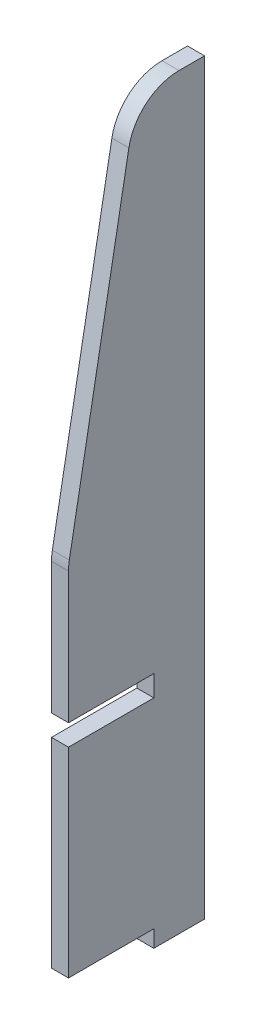
ISO-10303-21;
HEADER;
FILE_DESCRIPTION(('STEP AP214'),'2;1');
FILE_NAME('part.step','',(''),(''),'','','');
FILE_SCHEMA(('AUTOMOTIVE_DESIGN { 1 0 10303 214 1 1 1 1 }'));
ENDSEC;
DATA;
#1=APPLICATION_CONTEXT('core data for automotive mechanical design processes');
#2=APPLICATION_PROTOCOL_DEFINITION('international standard','automotive_design',2000,#1);
#3=PRODUCT_CONTEXT('',#1,'mechanical');
#4=PRODUCT('Part','Part','',(#3));
#5=PRODUCT_RELATED_PRODUCT_CATEGORY('part','',(#4));
#6=PRODUCT_DEFINITION_FORMATION('','',#4);
#7=PRODUCT_DEFINITION_CONTEXT('part definition',#1,'design');
#8=PRODUCT_DEFINITION('design','',#6,#7);
#9=PRODUCT_DEFINITION_SHAPE('','',#8);
#10=(LENGTH_UNIT() NAMED_UNIT(*) SI_UNIT(.MILLI.,.METRE.));
#11=(NAMED_UNIT(*) PLANE_ANGLE_UNIT() SI_UNIT($,.RADIAN.));
#12=(NAMED_UNIT(*) SI_UNIT($,.STERADIAN.) SOLID_ANGLE_UNIT());
#13=UNCERTAINTY_MEASURE_WITH_UNIT(LENGTH_MEASURE(1.E-05),#10,'distance_accuracy_value','');
#14=(GEOMETRIC_REPRESENTATION_CONTEXT(3) GLOBAL_UNCERTAINTY_ASSIGNED_CONTEXT((#13)) GLOBAL_UNIT_ASSIGNED_CONTEXT((#10,
#11,#12)) REPRESENTATION_CONTEXT('',''));
#15=CARTESIAN_POINT('',(0.,0.,0.));
#16=DIRECTION('',(0.,0.,1.));
#17=DIRECTION('',(1.,0.,0.));
#18=AXIS2_PLACEMENT_3D('',#15,#16,#17);
#19=CARTESIAN_POINT('',(135.,-58.8,-55.2));
#20=DIRECTION('',(0.,1.,0.));
#21=DIRECTION('',(0.,0.,1.));
#22=AXIS2_PLACEMENT_3D('',#19,#20,#21);
#23=PLANE('',#22);
#24=DIRECTION('',(0.,0.,-1.));
#25=VECTOR('',#24,1.);
#26=CARTESIAN_POINT('',(125.,-58.8,-55.2));
#27=LINE('',#26,#25);
#28=CARTESIAN_POINT('',(125.,-58.8,-5.));
#29=VERTEX_POINT('',#28);
#30=CARTESIAN_POINT('',(125.,-58.8,-55.2));
#31=VERTEX_POINT('',#30);
#32=EDGE_CURVE('E156',#29,#31,#27,.T.);
#33=ORIENTED_EDGE('',*,*,#32,.T.);
#34=DIRECTION('',(-1.,0.,0.));
#35=VECTOR('',#34,1.);
#36=CARTESIAN_POINT('',(135.,-58.8,-55.2));
#37=LINE('',#36,#35);
#38=CARTESIAN_POINT('',(135.,-58.8,-55.2));
#39=VERTEX_POINT('',#38);
#40=EDGE_CURVE('E137',#39,#31,#37,.T.);
#41=ORIENTED_EDGE('',*,*,#40,.F.);
#42=DIRECTION('',(0.,0.,-1.));
#43=VECTOR('',#42,1.);
#44=CARTESIAN_POINT('',(135.,-58.8,-55.2));
#45=LINE('',#44,#43);
#46=CARTESIAN_POINT('',(135.,-58.8,-5.));
#47=VERTEX_POINT('',#46);
#48=EDGE_CURVE('E144',#47,#39,#45,.T.);
#49=ORIENTED_EDGE('',*,*,#48,.F.);
#50=DIRECTION('',(-1.,0.,0.));
#51=VECTOR('',#50,1.);
#52=CARTESIAN_POINT('',(135.,-58.8,-5.));
#53=LINE('',#52,#51);
#54=EDGE_CURVE('E212',#47,#29,#53,.T.);
#55=ORIENTED_EDGE('',*,*,#54,.T.);
#56=EDGE_LOOP('',(#33,#41,#49,#55));
#57=FACE_BOUND('',#56,.T.);
#58=ADVANCED_FACE('F36',(#57),#23,.F.);
#59=CARTESIAN_POINT('',(135.,-58.8,-55.2));
#60=DIRECTION('',(0.,0.,-1.));
#61=DIRECTION('',(-1.,0.,0.));
#62=AXIS2_PLACEMENT_3D('',#59,#60,#61);
#63=PLANE('',#62);
#64=DIRECTION('',(0.,-1.,0.));
#65=VECTOR('',#64,1.);
#66=CARTESIAN_POINT('',(125.,-58.8,-55.2));
#67=LINE('',#66,#65);
#68=CARTESIAN_POINT('',(125.,-68.8,-55.2));
#69=VERTEX_POINT('',#68);
#70=EDGE_CURVE('E238',#31,#69,#67,.T.);
#71=ORIENTED_EDGE('',*,*,#70,.T.);
#72=DIRECTION('',(-1.,0.,0.));
#73=VECTOR('',#72,1.);
#74=CARTESIAN_POINT('',(135.,-68.8,-55.2));
#75=LINE('',#74,#73);
#76=CARTESIAN_POINT('',(135.,-68.8,-55.2));
#77=VERTEX_POINT('',#76);
#78=EDGE_CURVE('E140',#77,#69,#75,.T.);
#79=ORIENTED_EDGE('',*,*,#78,.F.);
#80=DIRECTION('',(0.,-1.,0.));
#81=VECTOR('',#80,1.);
#82=CARTESIAN_POINT('',(135.,-58.8,-55.2));
#83=LINE('',#82,#81);
#84=EDGE_CURVE('E133',#39,#77,#83,.T.);
#85=ORIENTED_EDGE('',*,*,#84,.F.);
#86=ORIENTED_EDGE('',*,*,#40,.T.);
#87=EDGE_LOOP('',(#71,#79,#85,#86));
#88=FACE_BOUND('',#87,.T.);
#89=ADVANCED_FACE('F135',(#88),#63,.F.);
#90=CARTESIAN_POINT('',(135.,-68.8,-55.2));
#91=DIRECTION('',(0.,1.,0.));
#92=DIRECTION('',(0.,0.,1.));
#93=AXIS2_PLACEMENT_3D('',#90,#91,#92);
#94=PLANE('',#93);
#95=DIRECTION('',(0.,0.,-1.));
#96=VECTOR('',#95,1.);
#97=CARTESIAN_POINT('',(125.,-68.8,-55.2));
#98=LINE('',#97,#96);
#99=CARTESIAN_POINT('',(125.,-68.8,-85.));
#100=VERTEX_POINT('',#99);
#101=EDGE_CURVE('E237',#69,#100,#98,.T.);
#102=ORIENTED_EDGE('',*,*,#101,.T.);
#103=DIRECTION('',(-1.,0.,0.));
#104=VECTOR('',#103,1.);
#105=CARTESIAN_POINT('',(135.,-68.8,-85.));
#106=LINE('',#105,#104);
#107=CARTESIAN_POINT('',(135.,-68.8,-85.));
#108=VERTEX_POINT('',#107);
#109=EDGE_CURVE('E162',#108,#100,#106,.T.);
#110=ORIENTED_EDGE('',*,*,#109,.F.);
#111=DIRECTION('',(0.,0.,-1.));
#112=VECTOR('',#111,1.);
#113=CARTESIAN_POINT('',(135.,-68.8,-55.2));
#114=LINE('',#113,#112);
#115=EDGE_CURVE('E143',#77,#108,#114,.T.);
#116=ORIENTED_EDGE('',*,*,#115,.F.);
#117=ORIENTED_EDGE('',*,*,#78,.T.);
#118=EDGE_LOOP('',(#102,#110,#116,#117));
#119=FACE_BOUND('',#118,.T.);
#120=ADVANCED_FACE('F235',(#119),#94,.F.);
#121=CARTESIAN_POINT('',(135.,371.,-85.));
#122=DIRECTION('',(0.,0.,1.));
#123=DIRECTION('',(1.,0.,0.));
#124=AXIS2_PLACEMENT_3D('',#121,#122,#123);
#125=PLANE('',#124);
#126=DIRECTION('',(0.,1.,0.));
#127=VECTOR('',#126,1.);
#128=CARTESIAN_POINT('',(125.,371.,-85.));
#129=LINE('',#128,#127);
#130=CARTESIAN_POINT('',(125.,371.,-85.));
#131=VERTEX_POINT('',#130);
#132=EDGE_CURVE('E202',#100,#131,#129,.T.);
#133=ORIENTED_EDGE('',*,*,#132,.T.);
#134=DIRECTION('',(-1.,0.,0.));
#135=VECTOR('',#134,1.);
#136=CARTESIAN_POINT('',(135.,371.,-85.));
#137=LINE('',#136,#135);
#138=CARTESIAN_POINT('',(135.,371.,-85.));
#139=VERTEX_POINT('',#138);
#140=EDGE_CURVE('E224',#139,#131,#137,.T.);
#141=ORIENTED_EDGE('',*,*,#140,.F.);
#142=DIRECTION('',(0.,1.,0.));
#143=VECTOR('',#142,1.);
#144=CARTESIAN_POINT('',(135.,-68.8,-85.));
#145=LINE('',#144,#143);
#146=EDGE_CURVE('E232',#108,#139,#145,.T.);
#147=ORIENTED_EDGE('',*,*,#146,.F.);
#148=ORIENTED_EDGE('',*,*,#109,.T.);
#149=EDGE_LOOP('',(#133,#141,#147,#148));
#150=FACE_BOUND('',#149,.T.);
#151=ADVANCED_FACE('F230',(#150),#125,.F.);
#152=CARTESIAN_POINT('',(135.,371.,-45.));
#153=DIRECTION('',(0.,-1.,0.));
#154=DIRECTION('',(0.,0.,-1.));
#155=AXIS2_PLACEMENT_3D('',#152,#153,#154);
#156=PLANE('',#155);
#157=DIRECTION('',(0.,0.,1.));
#158=VECTOR('',#157,1.);
#159=CARTESIAN_POINT('',(125.,371.,-45.));
#160=LINE('',#159,#158);
#161=CARTESIAN_POINT('',(125.,371.,-70.0332156459481));
#162=VERTEX_POINT('',#161);
#163=EDGE_CURVE('E198',#131,#162,#160,.T.);
#164=ORIENTED_EDGE('',*,*,#163,.T.);
#165=DIRECTION('',(-1.,0.,0.));
#166=VECTOR('',#165,1.);
#167=CARTESIAN_POINT('',(135.,371.,-70.0332156459481));
#168=LINE('',#167,#166);
#169=CARTESIAN_POINT('',(135.,371.,-70.0332156459481));
#170=VERTEX_POINT('',#169);
#171=EDGE_CURVE('E11',#162,#170,#168,.F.);
#172=ORIENTED_EDGE('',*,*,#171,.T.);
#173=DIRECTION('',(0.,0.,1.));
#174=VECTOR('',#173,1.);
#175=CARTESIAN_POINT('',(135.,371.,-45.));
#176=LINE('',#175,#174);
#177=EDGE_CURVE('E250',#139,#170,#176,.T.);
#178=ORIENTED_EDGE('',*,*,#177,.F.);
#179=ORIENTED_EDGE('',*,*,#140,.T.);
#180=EDGE_LOOP('',(#164,#172,#178,#179));
#181=FACE_BOUND('',#180,.T.);
#182=ADVANCED_FACE('F255',(#181),#156,.F.);
#183=CARTESIAN_POINT('',(135.,151.2,-5.));
#184=DIRECTION('',(0.,-0.179042993740706,-0.98384125060518));
#185=DIRECTION('',(0.,0.98384125060518,-0.179042993740706));
#186=AXIS2_PLACEMENT_3D('',#183,#184,#185);
#187=PLANE('',#186);
#188=DIRECTION('',(0.,-0.98384125060518,0.179042993740706));
#189=VECTOR('',#188,1.);
#190=CARTESIAN_POINT('',(125.,151.2,-5.));
#191=LINE('',#190,#189);
#192=CARTESIAN_POINT('',(125.,346.371289812221,-40.5179781277927));
#193=VERTEX_POINT('',#192);
#194=CARTESIAN_POINT('',(125.,153.863769837736,-5.48476248184458));
#195=VERTEX_POINT('',#194);
#196=EDGE_CURVE('E193',#193,#195,#191,.T.);
#197=ORIENTED_EDGE('',*,*,#196,.T.);
#198=DIRECTION('',(-1.,0.,0.));
#199=VECTOR('',#198,1.);
#200=CARTESIAN_POINT('',(135.,153.863769837736,-5.48476248184458));
#201=LINE('',#200,#199);
#202=CARTESIAN_POINT('',(135.,153.863769837736,-5.48476248184458));
#203=VERTEX_POINT('',#202);
#204=EDGE_CURVE('E57',#195,#203,#201,.F.);
#205=ORIENTED_EDGE('',*,*,#204,.T.);
#206=DIRECTION('',(0.,-0.98384125060518,0.179042993740706));
#207=VECTOR('',#206,1.);
#208=CARTESIAN_POINT('',(135.,151.2,-5.));
#209=LINE('',#208,#207);
#210=CARTESIAN_POINT('',(135.,346.371289812221,-40.5179781277927));
#211=VERTEX_POINT('',#210);
#212=EDGE_CURVE('E178',#211,#203,#209,.T.);
#213=ORIENTED_EDGE('',*,*,#212,.F.);
#214=DIRECTION('',(-1.,0.,0.));
#215=VECTOR('',#214,1.);
#216=CARTESIAN_POINT('',(135.,346.371289812221,-40.5179781277927));
#217=LINE('',#216,#215);
#218=EDGE_CURVE('E169',#211,#193,#217,.T.);
#219=ORIENTED_EDGE('',*,*,#218,.T.);
#220=EDGE_LOOP('',(#197,#205,#213,#219));
#221=FACE_BOUND('',#220,.T.);
#222=ADVANCED_FACE('F196',(#221),#187,.F.);
#223=CARTESIAN_POINT('',(135.,71.2,-5.));
#224=DIRECTION('',(0.,0.,-1.));
#225=DIRECTION('',(0.,1.,0.));
#226=AXIS2_PLACEMENT_3D('',#223,#224,#225);
#227=PLANE('',#226);
#228=DIRECTION('',(0.,-1.,0.));
#229=VECTOR('',#228,1.);
#230=CARTESIAN_POINT('',(135.,71.2,-5.));
#231=LINE('',#230,#229);
#232=CARTESIAN_POINT('',(135.,148.492480025515,-5.));
#233=VERTEX_POINT('',#232);
#234=CARTESIAN_POINT('',(135.,71.2,-5.));
#235=VERTEX_POINT('',#234);
#236=EDGE_CURVE('E176',#233,#235,#231,.T.);
#237=ORIENTED_EDGE('',*,*,#236,.F.);
#238=DIRECTION('',(-1.,0.,0.));
#239=VECTOR('',#238,1.);
#240=CARTESIAN_POINT('',(135.,148.492480025515,-5.));
#241=LINE('',#240,#239);
#242=CARTESIAN_POINT('',(125.,148.492480025515,-5.));
#243=VERTEX_POINT('',#242);
#244=EDGE_CURVE('E157',#233,#243,#241,.T.);
#245=ORIENTED_EDGE('',*,*,#244,.T.);
#246=DIRECTION('',(0.,-1.,0.));
#247=VECTOR('',#246,1.);
#248=CARTESIAN_POINT('',(125.,71.2,-5.));
#249=LINE('',#248,#247);
#250=CARTESIAN_POINT('',(125.,71.2,-5.));
#251=VERTEX_POINT('',#250);
#252=EDGE_CURVE('E195',#243,#251,#249,.T.);
#253=ORIENTED_EDGE('',*,*,#252,.T.);
#254=DIRECTION('',(-1.,0.,0.));
#255=VECTOR('',#254,1.);
#256=CARTESIAN_POINT('',(135.,71.2,-5.));
#257=LINE('',#256,#255);
#258=EDGE_CURVE('E185',#235,#251,#257,.T.);
#259=ORIENTED_EDGE('',*,*,#258,.F.);
#260=EDGE_LOOP('',(#237,#245,#253,#259));
#261=FACE_BOUND('',#260,.T.);
#262=ADVANCED_FACE('F182',(#261),#227,.F.);
#263=CARTESIAN_POINT('',(135.,71.2,-5.));
#264=DIRECTION('',(0.,1.,0.));
#265=DIRECTION('',(0.,0.,1.));
#266=AXIS2_PLACEMENT_3D('',#263,#264,#265);
#267=PLANE('',#266);
#268=DIRECTION('',(0.,0.,-1.));
#269=VECTOR('',#268,1.);
#270=CARTESIAN_POINT('',(125.,71.2,-5.));
#271=LINE('',#270,#269);
#272=CARTESIAN_POINT('',(125.,71.2,-55.2));
#273=VERTEX_POINT('',#272);
#274=EDGE_CURVE('E200',#251,#273,#271,.T.);
#275=ORIENTED_EDGE('',*,*,#274,.T.);
#276=DIRECTION('',(-1.,0.,0.));
#277=VECTOR('',#276,1.);
#278=CARTESIAN_POINT('',(135.,71.2,-55.2));
#279=LINE('',#278,#277);
#280=CARTESIAN_POINT('',(135.,71.2,-55.2));
#281=VERTEX_POINT('',#280);
#282=EDGE_CURVE('E220',#281,#273,#279,.T.);
#283=ORIENTED_EDGE('',*,*,#282,.F.);
#284=DIRECTION('',(0.,0.,-1.));
#285=VECTOR('',#284,1.);
#286=CARTESIAN_POINT('',(135.,71.2,-5.));
#287=LINE('',#286,#285);
#288=EDGE_CURVE('E187',#235,#281,#287,.T.);
#289=ORIENTED_EDGE('',*,*,#288,.F.);
#290=ORIENTED_EDGE('',*,*,#258,.T.);
#291=EDGE_LOOP('',(#275,#283,#289,#290));
#292=FACE_BOUND('',#291,.T.);
#293=ADVANCED_FACE('F294',(#292),#267,.F.);
#294=CARTESIAN_POINT('',(135.,58.8,-55.2));
#295=DIRECTION('',(0.,0.,-1.));
#296=DIRECTION('',(-1.,0.,0.));
#297=AXIS2_PLACEMENT_3D('',#294,#295,#296);
#298=PLANE('',#297);
#299=DIRECTION('',(0.,-1.,0.));
#300=VECTOR('',#299,1.);
#301=CARTESIAN_POINT('',(125.,58.8,-55.2));
#302=LINE('',#301,#300);
#303=CARTESIAN_POINT('',(125.,58.8,-55.2));
#304=VERTEX_POINT('',#303);
#305=EDGE_CURVE('E207',#273,#304,#302,.T.);
#306=ORIENTED_EDGE('',*,*,#305,.T.);
#307=DIRECTION('',(-1.,0.,0.));
#308=VECTOR('',#307,1.);
#309=CARTESIAN_POINT('',(135.,58.8,-55.2));
#310=LINE('',#309,#308);
#311=CARTESIAN_POINT('',(135.,58.8,-55.2));
#312=VERTEX_POINT('',#311);
#313=EDGE_CURVE('E217',#312,#304,#310,.T.);
#314=ORIENTED_EDGE('',*,*,#313,.F.);
#315=DIRECTION('',(0.,-1.,0.));
#316=VECTOR('',#315,1.);
#317=CARTESIAN_POINT('',(135.,58.8,-55.2));
#318=LINE('',#317,#316);
#319=EDGE_CURVE('E246',#281,#312,#318,.T.);
#320=ORIENTED_EDGE('',*,*,#319,.F.);
#321=ORIENTED_EDGE('',*,*,#282,.T.);
#322=EDGE_LOOP('',(#306,#314,#320,#321));
#323=FACE_BOUND('',#322,.T.);
#324=ADVANCED_FACE('F290',(#323),#298,.F.);
#325=CARTESIAN_POINT('',(135.,58.8,-5.));
#326=DIRECTION('',(0.,-1.,0.));
#327=DIRECTION('',(0.,0.,-1.));
#328=AXIS2_PLACEMENT_3D('',#325,#326,#327);
#329=PLANE('',#328);
#330=DIRECTION('',(0.,0.,1.));
#331=VECTOR('',#330,1.);
#332=CARTESIAN_POINT('',(125.,58.8,-5.));
#333=LINE('',#332,#331);
#334=CARTESIAN_POINT('',(125.,58.8,-5.));
#335=VERTEX_POINT('',#334);
#336=EDGE_CURVE('E209',#304,#335,#333,.T.);
#337=ORIENTED_EDGE('',*,*,#336,.T.);
#338=DIRECTION('',(-1.,0.,0.));
#339=VECTOR('',#338,1.);
#340=CARTESIAN_POINT('',(135.,58.8,-5.));
#341=LINE('',#340,#339);
#342=CARTESIAN_POINT('',(135.,58.8,-5.));
#343=VERTEX_POINT('',#342);
#344=EDGE_CURVE('E214',#343,#335,#341,.T.);
#345=ORIENTED_EDGE('',*,*,#344,.F.);
#346=DIRECTION('',(0.,0.,1.));
#347=VECTOR('',#346,1.);
#348=CARTESIAN_POINT('',(135.,58.8,-5.));
#349=LINE('',#348,#347);
#350=EDGE_CURVE('E244',#312,#343,#349,.T.);
#351=ORIENTED_EDGE('',*,*,#350,.F.);
#352=ORIENTED_EDGE('',*,*,#313,.T.);
#353=EDGE_LOOP('',(#337,#345,#351,#352));
#354=FACE_BOUND('',#353,.T.);
#355=ADVANCED_FACE('F286',(#354),#329,.F.);
#356=CARTESIAN_POINT('',(135.,-58.8,-5.));
#357=DIRECTION('',(0.,0.,-1.));
#358=DIRECTION('',(0.,1.,0.));
#359=AXIS2_PLACEMENT_3D('',#356,#357,#358);
#360=PLANE('',#359);
#361=DIRECTION('',(0.,-1.,0.));
#362=VECTOR('',#361,1.);
#363=CARTESIAN_POINT('',(125.,-58.8,-5.));
#364=LINE('',#363,#362);
#365=EDGE_CURVE('E153',#335,#29,#364,.T.);
#366=ORIENTED_EDGE('',*,*,#365,.T.);
#367=ORIENTED_EDGE('',*,*,#54,.F.);
#368=DIRECTION('',(0.,-1.,0.));
#369=VECTOR('',#368,1.);
#370=CARTESIAN_POINT('',(135.,-58.8,-5.));
#371=LINE('',#370,#369);
#372=EDGE_CURVE('E149',#343,#47,#371,.T.);
#373=ORIENTED_EDGE('',*,*,#372,.F.);
#374=ORIENTED_EDGE('',*,*,#344,.T.);
#375=EDGE_LOOP('',(#366,#367,#373,#374));
#376=FACE_BOUND('',#375,.T.);
#377=ADVANCED_FACE('F281',(#376),#360,.F.);
#378=CARTESIAN_POINT('',(135.,0.,0.));
#379=DIRECTION('',(-1.,0.,0.));
#380=DIRECTION('',(0.,0.,1.));
#381=AXIS2_PLACEMENT_3D('',#378,#379,#380);
#382=PLANE('',#381);
#383=ORIENTED_EDGE('',*,*,#212,.T.);
#384=CARTESIAN_POINT('',(135.,148.492480025515,-35.));
#385=DIRECTION('',(-1.,0.,0.));
#386=DIRECTION('',(0.,0.,1.));
#387=AXIS2_PLACEMENT_3D('',#384,#385,#386);
#388=CIRCLE('',#387,30.);
#389=EDGE_CURVE('E44',#203,#233,#388,.F.);
#390=ORIENTED_EDGE('',*,*,#389,.T.);
#391=ORIENTED_EDGE('',*,*,#236,.T.);
#392=ORIENTED_EDGE('',*,*,#288,.T.);
#393=ORIENTED_EDGE('',*,*,#319,.T.);
#394=ORIENTED_EDGE('',*,*,#350,.T.);
#395=ORIENTED_EDGE('',*,*,#372,.T.);
#396=ORIENTED_EDGE('',*,*,#48,.T.);
#397=ORIENTED_EDGE('',*,*,#84,.T.);
#398=ORIENTED_EDGE('',*,*,#115,.T.);
#399=ORIENTED_EDGE('',*,*,#146,.T.);
#400=ORIENTED_EDGE('',*,*,#177,.T.);
#401=CARTESIAN_POINT('',(135.,341.,-70.0332156459481));
#402=DIRECTION('',(-1.,0.,0.));
#403=DIRECTION('',(0.,0.,1.));
#404=AXIS2_PLACEMENT_3D('',#401,#402,#403);
#405=CIRCLE('',#404,30.);
#406=EDGE_CURVE('E173',#170,#211,#405,.F.);
#407=ORIENTED_EDGE('',*,*,#406,.T.);
#408=EDGE_LOOP('',(#383,#390,#391,#392,#393,#394,#395,#396,#397,#398,#399,#400,#407));
#409=FACE_BOUND('',#408,.T.);
#410=ADVANCED_FACE('F147',(#409),#382,.F.);
#411=CARTESIAN_POINT('',(125.,0.,0.));
#412=DIRECTION('',(-1.,0.,0.));
#413=DIRECTION('',(0.,0.,1.));
#414=AXIS2_PLACEMENT_3D('',#411,#412,#413);
#415=PLANE('',#414);
#416=ORIENTED_EDGE('',*,*,#252,.F.);
#417=CARTESIAN_POINT('',(125.,148.492480025515,-35.));
#418=DIRECTION('',(-1.,0.,0.));
#419=DIRECTION('',(0.,0.,1.));
#420=AXIS2_PLACEMENT_3D('',#417,#418,#419);
#421=CIRCLE('',#420,30.);
#422=EDGE_CURVE('E167',#243,#195,#421,.T.);
#423=ORIENTED_EDGE('',*,*,#422,.T.);
#424=ORIENTED_EDGE('',*,*,#196,.F.);
#425=CARTESIAN_POINT('',(125.,341.,-70.0332156459481));
#426=DIRECTION('',(-1.,0.,0.));
#427=DIRECTION('',(0.,0.,1.));
#428=AXIS2_PLACEMENT_3D('',#425,#426,#427);
#429=CIRCLE('',#428,30.);
#430=EDGE_CURVE('E160',#193,#162,#429,.T.);
#431=ORIENTED_EDGE('',*,*,#430,.T.);
#432=ORIENTED_EDGE('',*,*,#163,.F.);
#433=ORIENTED_EDGE('',*,*,#132,.F.);
#434=ORIENTED_EDGE('',*,*,#101,.F.);
#435=ORIENTED_EDGE('',*,*,#70,.F.);
#436=ORIENTED_EDGE('',*,*,#32,.F.);
#437=ORIENTED_EDGE('',*,*,#365,.F.);
#438=ORIENTED_EDGE('',*,*,#336,.F.);
#439=ORIENTED_EDGE('',*,*,#305,.F.);
#440=ORIENTED_EDGE('',*,*,#274,.F.);
#441=EDGE_LOOP('',(#416,#423,#424,#431,#432,#433,#434,#435,#436,#437,#438,#439,#440));
#442=FACE_BOUND('',#441,.T.);
#443=ADVANCED_FACE('F192',(#442),#415,.T.);
#444=CARTESIAN_POINT('',(135.,148.492480025515,-35.));
#445=DIRECTION('',(-1.,0.,0.));
#446=DIRECTION('',(0.,0.,1.));
#447=AXIS2_PLACEMENT_3D('',#444,#445,#446);
#448=CYLINDRICAL_SURFACE('',#447,30.);
#449=ORIENTED_EDGE('',*,*,#389,.F.);
#450=ORIENTED_EDGE('',*,*,#204,.F.);
#451=ORIENTED_EDGE('',*,*,#422,.F.);
#452=ORIENTED_EDGE('',*,*,#244,.F.);
#453=EDGE_LOOP('',(#449,#450,#451,#452));
#454=FACE_BOUND('',#453,.T.);
#455=ADVANCED_FACE('F189',(#454),#448,.T.);
#456=CARTESIAN_POINT('',(135.,341.,-70.0332156459481));
#457=DIRECTION('',(-1.,0.,0.));
#458=DIRECTION('',(0.,0.,1.));
#459=AXIS2_PLACEMENT_3D('',#456,#457,#458);
#460=CYLINDRICAL_SURFACE('',#459,30.);
#461=ORIENTED_EDGE('',*,*,#406,.F.);
#462=ORIENTED_EDGE('',*,*,#171,.F.);
#463=ORIENTED_EDGE('',*,*,#430,.F.);
#464=ORIENTED_EDGE('',*,*,#218,.F.);
#465=EDGE_LOOP('',(#461,#462,#463,#464));
#466=FACE_BOUND('',#465,.T.);
#467=ADVANCED_FACE('F38',(#466),#460,.T.);
#468=CLOSED_SHELL('',(#58,#89,#120,#151,#182,#222,#262,#293,#324,#355,#377,#410,#443,#455,#467));
#469=MANIFOLD_SOLID_BREP('B2',#468);
#470=ADVANCED_BREP_SHAPE_REPRESENTATION('',(#18,#469),#14);
#471=SHAPE_DEFINITION_REPRESENTATION(#9,#470);
ENDSEC;
END-ISO-10303-21;
